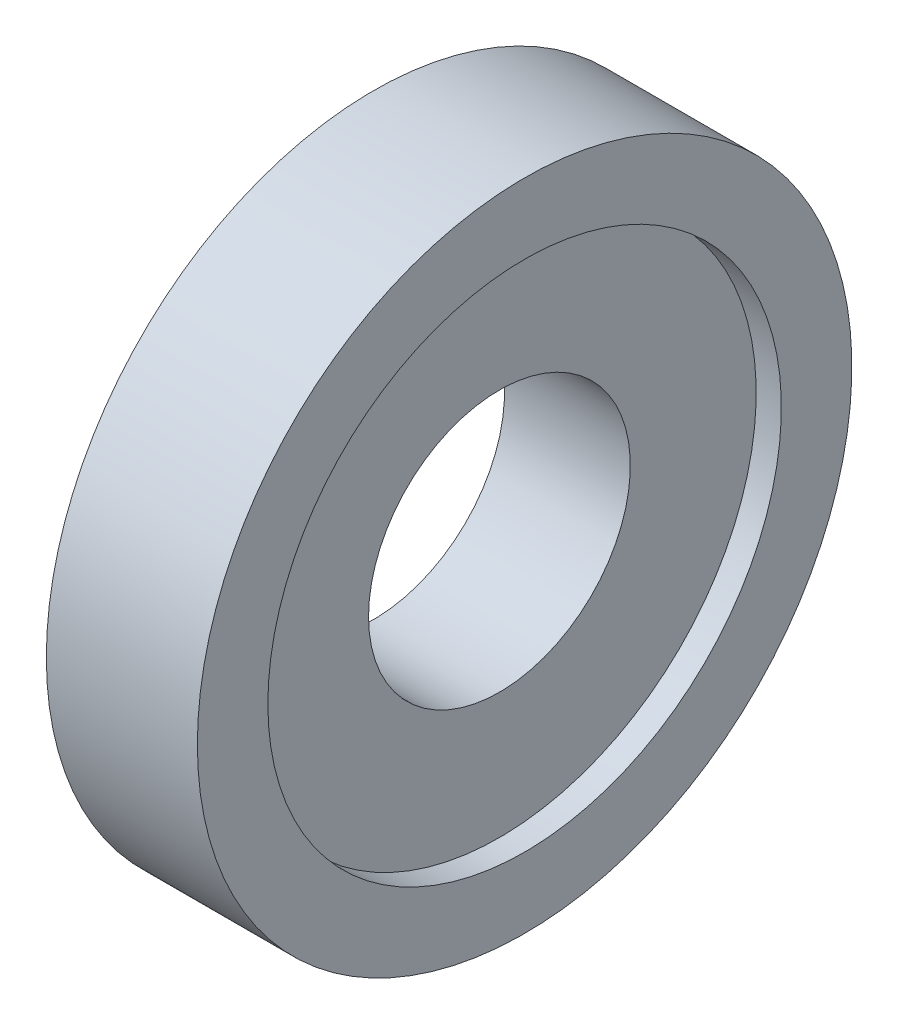
ISO-10303-21;
HEADER;
FILE_DESCRIPTION(('STEP AP214'),'2;1');
FILE_NAME('part.step','',(''),(''),'','','');
FILE_SCHEMA(('AUTOMOTIVE_DESIGN { 1 0 10303 214 1 1 1 1 }'));
ENDSEC;
DATA;
#1=APPLICATION_CONTEXT('core data for automotive mechanical design processes');
#2=APPLICATION_PROTOCOL_DEFINITION('international standard','automotive_design',2000,#1);
#3=PRODUCT_CONTEXT('',#1,'mechanical');
#4=PRODUCT('Part','Part','',(#3));
#5=PRODUCT_RELATED_PRODUCT_CATEGORY('part','',(#4));
#6=PRODUCT_DEFINITION_FORMATION('','',#4);
#7=PRODUCT_DEFINITION_CONTEXT('part definition',#1,'design');
#8=PRODUCT_DEFINITION('design','',#6,#7);
#9=PRODUCT_DEFINITION_SHAPE('','',#8);
#10=(LENGTH_UNIT() NAMED_UNIT(*) SI_UNIT(.MILLI.,.METRE.));
#11=(NAMED_UNIT(*) PLANE_ANGLE_UNIT() SI_UNIT($,.RADIAN.));
#12=(NAMED_UNIT(*) SI_UNIT($,.STERADIAN.) SOLID_ANGLE_UNIT());
#13=UNCERTAINTY_MEASURE_WITH_UNIT(LENGTH_MEASURE(1.E-05),#10,'distance_accuracy_value','');
#14=(GEOMETRIC_REPRESENTATION_CONTEXT(3) GLOBAL_UNCERTAINTY_ASSIGNED_CONTEXT((#13)) GLOBAL_UNIT_ASSIGNED_CONTEXT((#10,
#11,#12)) REPRESENTATION_CONTEXT('',''));
#15=CARTESIAN_POINT('',(0.,0.,0.));
#16=DIRECTION('',(0.,0.,1.));
#17=DIRECTION('',(1.,0.,0.));
#18=AXIS2_PLACEMENT_3D('',#15,#16,#17);
#19=CARTESIAN_POINT('',(0.,0.,0.));
#20=DIRECTION('',(-1.,0.,0.));
#21=DIRECTION('',(0.,0.,1.));
#22=AXIS2_PLACEMENT_3D('',#19,#20,#21);
#23=CYLINDRICAL_SURFACE('',#22,2.6);
#24=CARTESIAN_POINT('',(2.5,0.,0.));
#25=DIRECTION('',(-1.,0.,0.));
#26=DIRECTION('',(0.,0.,1.));
#27=AXIS2_PLACEMENT_3D('',#24,#25,#26);
#28=CIRCLE('',#27,2.6);
#29=CARTESIAN_POINT('',(2.5,0.,2.6));
#30=VERTEX_POINT('',#29);
#31=EDGE_CURVE('E56',#30,#30,#28,.T.);
#32=ORIENTED_EDGE('',*,*,#31,.F.);
#33=EDGE_LOOP('',(#32));
#34=FACE_BOUND('',#33,.T.);
#35=CARTESIAN_POINT('',(0.,0.,0.));
#36=DIRECTION('',(-1.,0.,0.));
#37=DIRECTION('',(0.,0.,1.));
#38=AXIS2_PLACEMENT_3D('',#35,#36,#37);
#39=CIRCLE('',#38,2.6);
#40=CARTESIAN_POINT('',(0.,0.,2.6));
#41=VERTEX_POINT('',#40);
#42=EDGE_CURVE('E10',#41,#41,#39,.T.);
#43=ORIENTED_EDGE('',*,*,#42,.T.);
#44=EDGE_LOOP('',(#43));
#45=FACE_BOUND('',#44,.T.);
#46=ADVANCED_FACE('F34',(#34,#45),#23,.F.);
#47=CARTESIAN_POINT('',(0.,2.6,0.));
#48=DIRECTION('',(1.,0.,0.));
#49=DIRECTION('',(0.,0.,-1.));
#50=AXIS2_PLACEMENT_3D('',#47,#48,#49);
#51=PLANE('',#50);
#52=ORIENTED_EDGE('',*,*,#42,.F.);
#53=EDGE_LOOP('',(#52));
#54=FACE_BOUND('',#53,.T.);
#55=CARTESIAN_POINT('',(0.,0.,0.));
#56=DIRECTION('',(-1.,0.,0.));
#57=DIRECTION('',(0.,0.,1.));
#58=AXIS2_PLACEMENT_3D('',#55,#56,#57);
#59=CIRCLE('',#58,6.5);
#60=CARTESIAN_POINT('',(0.,0.,6.5));
#61=VERTEX_POINT('',#60);
#62=EDGE_CURVE('E40',#61,#61,#59,.T.);
#63=ORIENTED_EDGE('',*,*,#62,.T.);
#64=EDGE_LOOP('',(#63));
#65=FACE_BOUND('',#64,.T.);
#66=ADVANCED_FACE('F63',(#54,#65),#51,.F.);
#67=CARTESIAN_POINT('',(0.,0.,0.));
#68=DIRECTION('',(-1.,0.,0.));
#69=DIRECTION('',(0.,0.,1.));
#70=AXIS2_PLACEMENT_3D('',#67,#68,#69);
#71=CYLINDRICAL_SURFACE('',#70,6.5);
#72=ORIENTED_EDGE('',*,*,#62,.F.);
#73=EDGE_LOOP('',(#72));
#74=FACE_BOUND('',#73,.T.);
#75=CARTESIAN_POINT('',(3.,0.,0.));
#76=DIRECTION('',(-1.,0.,0.));
#77=DIRECTION('',(0.,0.,1.));
#78=AXIS2_PLACEMENT_3D('',#75,#76,#77);
#79=CIRCLE('',#78,6.5);
#80=CARTESIAN_POINT('',(3.,0.,6.5));
#81=VERTEX_POINT('',#80);
#82=EDGE_CURVE('E44',#81,#81,#79,.T.);
#83=ORIENTED_EDGE('',*,*,#82,.T.);
#84=EDGE_LOOP('',(#83));
#85=FACE_BOUND('',#84,.T.);
#86=ADVANCED_FACE('F67',(#74,#85),#71,.T.);
#87=CARTESIAN_POINT('',(3.,6.5,0.));
#88=DIRECTION('',(-1.,0.,0.));
#89=DIRECTION('',(0.,0.,1.));
#90=AXIS2_PLACEMENT_3D('',#87,#88,#89);
#91=PLANE('',#90);
#92=ORIENTED_EDGE('',*,*,#82,.F.);
#93=EDGE_LOOP('',(#92));
#94=FACE_BOUND('',#93,.T.);
#95=CARTESIAN_POINT('',(3.,0.,0.));
#96=DIRECTION('',(-1.,0.,0.));
#97=DIRECTION('',(0.,0.,1.));
#98=AXIS2_PLACEMENT_3D('',#95,#96,#97);
#99=CIRCLE('',#98,5.1);
#100=CARTESIAN_POINT('',(3.,0.,5.1));
#101=VERTEX_POINT('',#100);
#102=EDGE_CURVE('E48',#101,#101,#99,.T.);
#103=ORIENTED_EDGE('',*,*,#102,.T.);
#104=EDGE_LOOP('',(#103));
#105=FACE_BOUND('',#104,.T.);
#106=ADVANCED_FACE('F72',(#94,#105),#91,.F.);
#107=CARTESIAN_POINT('',(0.,0.,0.));
#108=DIRECTION('',(-1.,0.,0.));
#109=DIRECTION('',(0.,0.,1.));
#110=AXIS2_PLACEMENT_3D('',#107,#108,#109);
#111=CYLINDRICAL_SURFACE('',#110,5.1);
#112=ORIENTED_EDGE('',*,*,#102,.F.);
#113=EDGE_LOOP('',(#112));
#114=FACE_BOUND('',#113,.T.);
#115=CARTESIAN_POINT('',(2.5,0.,0.));
#116=DIRECTION('',(-1.,0.,0.));
#117=DIRECTION('',(0.,0.,1.));
#118=AXIS2_PLACEMENT_3D('',#115,#116,#117);
#119=CIRCLE('',#118,5.1);
#120=CARTESIAN_POINT('',(2.5,0.,5.1));
#121=VERTEX_POINT('',#120);
#122=EDGE_CURVE('E53',#121,#121,#119,.T.);
#123=ORIENTED_EDGE('',*,*,#122,.T.);
#124=EDGE_LOOP('',(#123));
#125=FACE_BOUND('',#124,.T.);
#126=ADVANCED_FACE('F78',(#114,#125),#111,.F.);
#127=CARTESIAN_POINT('',(2.5,5.1,0.));
#128=DIRECTION('',(-1.,0.,0.));
#129=DIRECTION('',(0.,0.,1.));
#130=AXIS2_PLACEMENT_3D('',#127,#128,#129);
#131=PLANE('',#130);
#132=ORIENTED_EDGE('',*,*,#122,.F.);
#133=EDGE_LOOP('',(#132));
#134=FACE_BOUND('',#133,.T.);
#135=ORIENTED_EDGE('',*,*,#31,.T.);
#136=EDGE_LOOP('',(#135));
#137=FACE_BOUND('',#136,.T.);
#138=ADVANCED_FACE('F60',(#134,#137),#131,.F.);
#139=CLOSED_SHELL('',(#46,#66,#86,#106,#126,#138));
#140=MANIFOLD_SOLID_BREP('B2',#139);
#141=ADVANCED_BREP_SHAPE_REPRESENTATION('',(#18,#140),#14);
#142=SHAPE_DEFINITION_REPRESENTATION(#9,#141);
ENDSEC;
END-ISO-10303-21;
